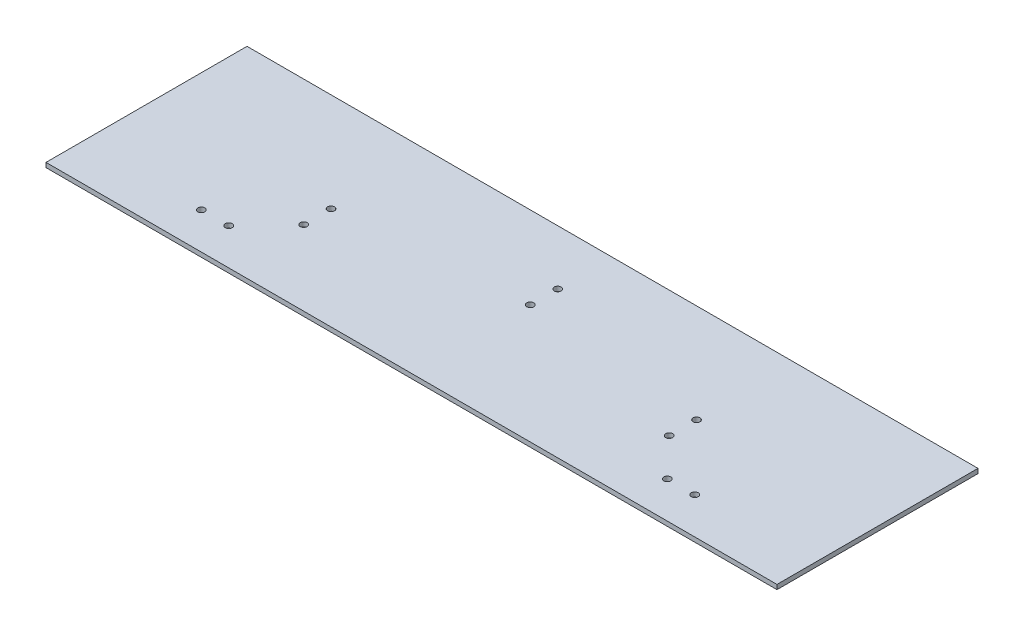
ISO-10303-21;
HEADER;
FILE_DESCRIPTION(('STEP AP214'),'2;1');
FILE_NAME('part.step','',(''),(''),'','','');
FILE_SCHEMA(('AUTOMOTIVE_DESIGN { 1 0 10303 214 1 1 1 1 }'));
ENDSEC;
DATA;
#1=APPLICATION_CONTEXT('core data for automotive mechanical design processes');
#2=APPLICATION_PROTOCOL_DEFINITION('international standard','automotive_design',2000,#1);
#3=PRODUCT_CONTEXT('',#1,'mechanical');
#4=PRODUCT('Part','Part','',(#3));
#5=PRODUCT_RELATED_PRODUCT_CATEGORY('part','',(#4));
#6=PRODUCT_DEFINITION_FORMATION('','',#4);
#7=PRODUCT_DEFINITION_CONTEXT('part definition',#1,'design');
#8=PRODUCT_DEFINITION('design','',#6,#7);
#9=PRODUCT_DEFINITION_SHAPE('','',#8);
#10=(LENGTH_UNIT() NAMED_UNIT(*) SI_UNIT(.MILLI.,.METRE.));
#11=(NAMED_UNIT(*) PLANE_ANGLE_UNIT() SI_UNIT($,.RADIAN.));
#12=(NAMED_UNIT(*) SI_UNIT($,.STERADIAN.) SOLID_ANGLE_UNIT());
#13=UNCERTAINTY_MEASURE_WITH_UNIT(LENGTH_MEASURE(1.E-05),#10,'distance_accuracy_value','');
#14=(GEOMETRIC_REPRESENTATION_CONTEXT(3) GLOBAL_UNCERTAINTY_ASSIGNED_CONTEXT((#13)) GLOBAL_UNIT_ASSIGNED_CONTEXT((#10,
#11,#12)) REPRESENTATION_CONTEXT('',''));
#15=CARTESIAN_POINT('',(0.,0.,0.));
#16=DIRECTION('',(0.,0.,1.));
#17=DIRECTION('',(1.,0.,0.));
#18=AXIS2_PLACEMENT_3D('',#15,#16,#17);
#19=CARTESIAN_POINT('',(0.,3.175,0.));
#20=DIRECTION('',(1.,0.,0.));
#21=DIRECTION('',(0.,0.,-1.));
#22=AXIS2_PLACEMENT_3D('',#19,#20,#21);
#23=PLANE('',#22);
#24=DIRECTION('',(0.,0.,1.));
#25=VECTOR('',#24,1.);
#26=CARTESIAN_POINT('',(0.,0.,0.));
#27=LINE('',#26,#25);
#28=CARTESIAN_POINT('',(0.,0.,0.));
#29=VERTEX_POINT('',#28);
#30=CARTESIAN_POINT('',(0.,0.,139.7));
#31=VERTEX_POINT('',#30);
#32=EDGE_CURVE('E96',#29,#31,#27,.T.);
#33=ORIENTED_EDGE('',*,*,#32,.T.);
#34=DIRECTION('',(0.,-1.,0.));
#35=VECTOR('',#34,1.);
#36=CARTESIAN_POINT('',(0.,3.175,139.7));
#37=LINE('',#36,#35);
#38=CARTESIAN_POINT('',(0.,3.175,139.7));
#39=VERTEX_POINT('',#38);
#40=EDGE_CURVE('E11',#39,#31,#37,.T.);
#41=ORIENTED_EDGE('',*,*,#40,.F.);
#42=DIRECTION('',(0.,0.,1.));
#43=VECTOR('',#42,1.);
#44=CARTESIAN_POINT('',(0.,3.175,0.));
#45=LINE('',#44,#43);
#46=CARTESIAN_POINT('',(0.,3.175,0.));
#47=VERTEX_POINT('',#46);
#48=EDGE_CURVE('E84',#47,#39,#45,.T.);
#49=ORIENTED_EDGE('',*,*,#48,.F.);
#50=DIRECTION('',(0.,-1.,0.));
#51=VECTOR('',#50,1.);
#52=CARTESIAN_POINT('',(0.,3.175,0.));
#53=LINE('',#52,#51);
#54=EDGE_CURVE('E92',#47,#29,#53,.T.);
#55=ORIENTED_EDGE('',*,*,#54,.T.);
#56=EDGE_LOOP('',(#33,#41,#49,#55));
#57=FACE_BOUND('',#56,.T.);
#58=ADVANCED_FACE('F33',(#57),#23,.F.);
#59=CARTESIAN_POINT('',(0.,3.175,139.7));
#60=DIRECTION('',(0.,0.,-1.));
#61=DIRECTION('',(-1.,0.,0.));
#62=AXIS2_PLACEMENT_3D('',#59,#60,#61);
#63=PLANE('',#62);
#64=DIRECTION('',(1.,0.,0.));
#65=VECTOR('',#64,1.);
#66=CARTESIAN_POINT('',(0.,0.,139.7));
#67=LINE('',#66,#65);
#68=CARTESIAN_POINT('',(508.,0.,139.7));
#69=VERTEX_POINT('',#68);
#70=EDGE_CURVE('E88',#31,#69,#67,.T.);
#71=ORIENTED_EDGE('',*,*,#70,.T.);
#72=DIRECTION('',(0.,-1.,0.));
#73=VECTOR('',#72,1.);
#74=CARTESIAN_POINT('',(508.,3.175,139.7));
#75=LINE('',#74,#73);
#76=CARTESIAN_POINT('',(508.,3.175,139.7));
#77=VERTEX_POINT('',#76);
#78=EDGE_CURVE('E41',#77,#69,#75,.T.);
#79=ORIENTED_EDGE('',*,*,#78,.F.);
#80=DIRECTION('',(1.,0.,0.));
#81=VECTOR('',#80,1.);
#82=CARTESIAN_POINT('',(0.,3.175,139.7));
#83=LINE('',#82,#81);
#84=EDGE_CURVE('E79',#39,#77,#83,.T.);
#85=ORIENTED_EDGE('',*,*,#84,.F.);
#86=ORIENTED_EDGE('',*,*,#40,.T.);
#87=EDGE_LOOP('',(#71,#79,#85,#86));
#88=FACE_BOUND('',#87,.T.);
#89=ADVANCED_FACE('F87',(#88),#63,.F.);
#90=CARTESIAN_POINT('',(508.,3.175,0.));
#91=DIRECTION('',(-1.,0.,0.));
#92=DIRECTION('',(0.,0.,1.));
#93=AXIS2_PLACEMENT_3D('',#90,#91,#92);
#94=PLANE('',#93);
#95=DIRECTION('',(0.,0.,-1.));
#96=VECTOR('',#95,1.);
#97=CARTESIAN_POINT('',(508.,0.,0.));
#98=LINE('',#97,#96);
#99=CARTESIAN_POINT('',(508.,0.,0.));
#100=VERTEX_POINT('',#99);
#101=EDGE_CURVE('E66',#69,#100,#98,.T.);
#102=ORIENTED_EDGE('',*,*,#101,.T.);
#103=DIRECTION('',(0.,-1.,0.));
#104=VECTOR('',#103,1.);
#105=CARTESIAN_POINT('',(508.,3.175,0.));
#106=LINE('',#105,#104);
#107=CARTESIAN_POINT('',(508.,3.175,0.));
#108=VERTEX_POINT('',#107);
#109=EDGE_CURVE('E89',#108,#100,#106,.T.);
#110=ORIENTED_EDGE('',*,*,#109,.F.);
#111=DIRECTION('',(0.,0.,-1.));
#112=VECTOR('',#111,1.);
#113=CARTESIAN_POINT('',(508.,3.175,0.));
#114=LINE('',#113,#112);
#115=EDGE_CURVE('E82',#77,#108,#114,.T.);
#116=ORIENTED_EDGE('',*,*,#115,.F.);
#117=ORIENTED_EDGE('',*,*,#78,.T.);
#118=EDGE_LOOP('',(#102,#110,#116,#117));
#119=FACE_BOUND('',#118,.T.);
#120=ADVANCED_FACE('F90',(#119),#94,.F.);
#121=CARTESIAN_POINT('',(0.,3.175,0.));
#122=DIRECTION('',(0.,0.,1.));
#123=DIRECTION('',(1.,0.,0.));
#124=AXIS2_PLACEMENT_3D('',#121,#122,#123);
#125=PLANE('',#124);
#126=DIRECTION('',(-1.,0.,0.));
#127=VECTOR('',#126,1.);
#128=CARTESIAN_POINT('',(0.,0.,0.));
#129=LINE('',#128,#127);
#130=EDGE_CURVE('E72',#100,#29,#129,.T.);
#131=ORIENTED_EDGE('',*,*,#130,.T.);
#132=ORIENTED_EDGE('',*,*,#54,.F.);
#133=DIRECTION('',(-1.,0.,0.));
#134=VECTOR('',#133,1.);
#135=CARTESIAN_POINT('',(0.,3.175,0.));
#136=LINE('',#135,#134);
#137=EDGE_CURVE('E49',#108,#47,#136,.T.);
#138=ORIENTED_EDGE('',*,*,#137,.F.);
#139=ORIENTED_EDGE('',*,*,#109,.T.);
#140=EDGE_LOOP('',(#131,#132,#138,#139));
#141=FACE_BOUND('',#140,.T.);
#142=ADVANCED_FACE('F104',(#141),#125,.F.);
#143=CARTESIAN_POINT('',(0.,3.175,0.));
#144=DIRECTION('',(0.,1.,0.));
#145=DIRECTION('',(0.,0.,1.));
#146=AXIS2_PLACEMENT_3D('',#143,#144,#145);
#147=PLANE('',#146);
#148=CARTESIAN_POINT('',(82.55,3.175,114.3));
#149=DIRECTION('',(0.,1.,0.));
#150=DIRECTION('',(0.,0.,1.));
#151=AXIS2_PLACEMENT_3D('',#148,#149,#150);
#152=CIRCLE('',#151,2.41299999999999);
#153=CARTESIAN_POINT('',(82.55,3.175,116.713));
#154=VERTEX_POINT('',#153);
#155=EDGE_CURVE('E133',#154,#154,#152,.T.);
#156=ORIENTED_EDGE('',*,*,#155,.F.);
#157=EDGE_LOOP('',(#156));
#158=FACE_BOUND('',#157,.T.);
#159=CARTESIAN_POINT('',(381.,3.175,68.58));
#160=DIRECTION('',(0.,1.,0.));
#161=DIRECTION('',(0.,0.,1.));
#162=AXIS2_PLACEMENT_3D('',#159,#160,#161);
#163=CIRCLE('',#162,2.41299999999999);
#164=CARTESIAN_POINT('',(381.,3.175,70.993));
#165=VERTEX_POINT('',#164);
#166=EDGE_CURVE('E162',#165,#165,#163,.T.);
#167=ORIENTED_EDGE('',*,*,#166,.F.);
#168=EDGE_LOOP('',(#167));
#169=FACE_BOUND('',#168,.T.);
#170=CARTESIAN_POINT('',(101.6,3.175,114.3));
#171=DIRECTION('',(0.,1.,0.));
#172=DIRECTION('',(0.,0.,1.));
#173=AXIS2_PLACEMENT_3D('',#170,#171,#172);
#174=CIRCLE('',#173,2.41299999999999);
#175=CARTESIAN_POINT('',(101.6,3.175,116.713));
#176=VERTEX_POINT('',#175);
#177=EDGE_CURVE('E127',#176,#176,#174,.T.);
#178=ORIENTED_EDGE('',*,*,#177,.F.);
#179=EDGE_LOOP('',(#178));
#180=FACE_BOUND('',#179,.T.);
#181=CARTESIAN_POINT('',(127.,3.175,87.63));
#182=DIRECTION('',(0.,1.,0.));
#183=DIRECTION('',(0.,0.,1.));
#184=AXIS2_PLACEMENT_3D('',#181,#182,#183);
#185=CIRCLE('',#184,2.41299999999999);
#186=CARTESIAN_POINT('',(127.,3.175,90.043));
#187=VERTEX_POINT('',#186);
#188=EDGE_CURVE('E121',#187,#187,#185,.T.);
#189=ORIENTED_EDGE('',*,*,#188,.F.);
#190=EDGE_LOOP('',(#189));
#191=FACE_BOUND('',#190,.T.);
#192=CARTESIAN_POINT('',(127.,3.175,68.58));
#193=DIRECTION('',(0.,1.,0.));
#194=DIRECTION('',(0.,0.,1.));
#195=AXIS2_PLACEMENT_3D('',#192,#193,#194);
#196=CIRCLE('',#195,2.41299999999999);
#197=CARTESIAN_POINT('',(127.,3.175,70.993));
#198=VERTEX_POINT('',#197);
#199=EDGE_CURVE('E113',#198,#198,#196,.T.);
#200=ORIENTED_EDGE('',*,*,#199,.F.);
#201=EDGE_LOOP('',(#200));
#202=FACE_BOUND('',#201,.T.);
#203=CARTESIAN_POINT('',(254.,3.175,38.1));
#204=DIRECTION('',(0.,1.,0.));
#205=DIRECTION('',(0.,0.,1.));
#206=AXIS2_PLACEMENT_3D('',#203,#204,#205);
#207=CIRCLE('',#206,2.41299999999999);
#208=CARTESIAN_POINT('',(254.,3.175,40.513));
#209=VERTEX_POINT('',#208);
#210=EDGE_CURVE('E114',#209,#209,#207,.T.);
#211=ORIENTED_EDGE('',*,*,#210,.F.);
#212=EDGE_LOOP('',(#211));
#213=FACE_BOUND('',#212,.T.);
#214=CARTESIAN_POINT('',(381.,3.175,87.63));
#215=DIRECTION('',(0.,1.,0.));
#216=DIRECTION('',(0.,0.,1.));
#217=AXIS2_PLACEMENT_3D('',#214,#215,#216);
#218=CIRCLE('',#217,2.41299999999999);
#219=CARTESIAN_POINT('',(381.,3.175,90.043));
#220=VERTEX_POINT('',#219);
#221=EDGE_CURVE('E152',#220,#220,#218,.T.);
#222=ORIENTED_EDGE('',*,*,#221,.F.);
#223=EDGE_LOOP('',(#222));
#224=FACE_BOUND('',#223,.T.);
#225=CARTESIAN_POINT('',(406.4,3.175,114.3));
#226=DIRECTION('',(0.,1.,0.));
#227=DIRECTION('',(0.,0.,1.));
#228=AXIS2_PLACEMENT_3D('',#225,#226,#227);
#229=CIRCLE('',#228,2.41299999999999);
#230=CARTESIAN_POINT('',(406.4,3.175,116.713));
#231=VERTEX_POINT('',#230);
#232=EDGE_CURVE('E151',#231,#231,#229,.T.);
#233=ORIENTED_EDGE('',*,*,#232,.F.);
#234=EDGE_LOOP('',(#233));
#235=FACE_BOUND('',#234,.T.);
#236=CARTESIAN_POINT('',(425.45,3.175,114.3));
#237=DIRECTION('',(0.,1.,0.));
#238=DIRECTION('',(0.,0.,1.));
#239=AXIS2_PLACEMENT_3D('',#236,#237,#238);
#240=CIRCLE('',#239,2.41299999999999);
#241=CARTESIAN_POINT('',(425.45,3.175,116.713));
#242=VERTEX_POINT('',#241);
#243=EDGE_CURVE('E140',#242,#242,#240,.T.);
#244=ORIENTED_EDGE('',*,*,#243,.F.);
#245=EDGE_LOOP('',(#244));
#246=FACE_BOUND('',#245,.T.);
#247=CARTESIAN_POINT('',(254.,3.175,57.15));
#248=DIRECTION('',(0.,1.,0.));
#249=DIRECTION('',(0.,0.,1.));
#250=AXIS2_PLACEMENT_3D('',#247,#248,#249);
#251=CIRCLE('',#250,2.41299999999999);
#252=CARTESIAN_POINT('',(254.,3.175,59.563));
#253=VERTEX_POINT('',#252);
#254=EDGE_CURVE('E139',#253,#253,#251,.T.);
#255=ORIENTED_EDGE('',*,*,#254,.F.);
#256=EDGE_LOOP('',(#255));
#257=FACE_BOUND('',#256,.T.);
#258=ORIENTED_EDGE('',*,*,#48,.T.);
#259=ORIENTED_EDGE('',*,*,#84,.T.);
#260=ORIENTED_EDGE('',*,*,#115,.T.);
#261=ORIENTED_EDGE('',*,*,#137,.T.);
#262=EDGE_LOOP('',(#258,#259,#260,#261));
#263=FACE_BOUND('',#262,.T.);
#264=ADVANCED_FACE('F80',(#158,#169,#180,#191,#202,#213,#224,#235,#246,#257,#263),#147,.T.);
#265=CARTESIAN_POINT('',(0.,0.,0.));
#266=DIRECTION('',(0.,1.,0.));
#267=DIRECTION('',(0.,0.,1.));
#268=AXIS2_PLACEMENT_3D('',#265,#266,#267);
#269=PLANE('',#268);
#270=CARTESIAN_POINT('',(82.55,0.,114.3));
#271=DIRECTION('',(0.,1.,0.));
#272=DIRECTION('',(0.,0.,1.));
#273=AXIS2_PLACEMENT_3D('',#270,#271,#272);
#274=CIRCLE('',#273,2.41299999999999);
#275=CARTESIAN_POINT('',(82.55,0.,116.713));
#276=VERTEX_POINT('',#275);
#277=EDGE_CURVE('E99',#276,#276,#274,.F.);
#278=ORIENTED_EDGE('',*,*,#277,.F.);
#279=EDGE_LOOP('',(#278));
#280=FACE_BOUND('',#279,.T.);
#281=CARTESIAN_POINT('',(381.,0.,68.58));
#282=DIRECTION('',(0.,1.,0.));
#283=DIRECTION('',(0.,0.,1.));
#284=AXIS2_PLACEMENT_3D('',#281,#282,#283);
#285=CIRCLE('',#284,2.41299999999999);
#286=CARTESIAN_POINT('',(381.,0.,70.993));
#287=VERTEX_POINT('',#286);
#288=EDGE_CURVE('E155',#287,#287,#285,.F.);
#289=ORIENTED_EDGE('',*,*,#288,.F.);
#290=EDGE_LOOP('',(#289));
#291=FACE_BOUND('',#290,.T.);
#292=CARTESIAN_POINT('',(101.6,0.,114.3));
#293=DIRECTION('',(0.,1.,0.));
#294=DIRECTION('',(0.,0.,1.));
#295=AXIS2_PLACEMENT_3D('',#292,#293,#294);
#296=CIRCLE('',#295,2.41299999999999);
#297=CARTESIAN_POINT('',(101.6,0.,116.713));
#298=VERTEX_POINT('',#297);
#299=EDGE_CURVE('E130',#298,#298,#296,.F.);
#300=ORIENTED_EDGE('',*,*,#299,.F.);
#301=EDGE_LOOP('',(#300));
#302=FACE_BOUND('',#301,.T.);
#303=CARTESIAN_POINT('',(127.,0.,87.63));
#304=DIRECTION('',(0.,1.,0.));
#305=DIRECTION('',(0.,0.,1.));
#306=AXIS2_PLACEMENT_3D('',#303,#304,#305);
#307=CIRCLE('',#306,2.41299999999999);
#308=CARTESIAN_POINT('',(127.,0.,90.043));
#309=VERTEX_POINT('',#308);
#310=EDGE_CURVE('E124',#309,#309,#307,.F.);
#311=ORIENTED_EDGE('',*,*,#310,.F.);
#312=EDGE_LOOP('',(#311));
#313=FACE_BOUND('',#312,.T.);
#314=CARTESIAN_POINT('',(127.,0.,68.58));
#315=DIRECTION('',(0.,1.,0.));
#316=DIRECTION('',(0.,0.,1.));
#317=AXIS2_PLACEMENT_3D('',#314,#315,#316);
#318=CIRCLE('',#317,2.41299999999999);
#319=CARTESIAN_POINT('',(127.,0.,70.993));
#320=VERTEX_POINT('',#319);
#321=EDGE_CURVE('E118',#320,#320,#318,.F.);
#322=ORIENTED_EDGE('',*,*,#321,.F.);
#323=EDGE_LOOP('',(#322));
#324=FACE_BOUND('',#323,.T.);
#325=CARTESIAN_POINT('',(254.,0.,38.1));
#326=DIRECTION('',(0.,1.,0.));
#327=DIRECTION('',(0.,0.,1.));
#328=AXIS2_PLACEMENT_3D('',#325,#326,#327);
#329=CIRCLE('',#328,2.41299999999999);
#330=CARTESIAN_POINT('',(254.,0.,40.513));
#331=VERTEX_POINT('',#330);
#332=EDGE_CURVE('E110',#331,#331,#329,.F.);
#333=ORIENTED_EDGE('',*,*,#332,.F.);
#334=EDGE_LOOP('',(#333));
#335=FACE_BOUND('',#334,.T.);
#336=CARTESIAN_POINT('',(381.,0.,87.63));
#337=DIRECTION('',(0.,1.,0.));
#338=DIRECTION('',(0.,0.,1.));
#339=AXIS2_PLACEMENT_3D('',#336,#337,#338);
#340=CIRCLE('',#339,2.41299999999999);
#341=CARTESIAN_POINT('',(381.,0.,90.043));
#342=VERTEX_POINT('',#341);
#343=EDGE_CURVE('E148',#342,#342,#340,.F.);
#344=ORIENTED_EDGE('',*,*,#343,.F.);
#345=EDGE_LOOP('',(#344));
#346=FACE_BOUND('',#345,.T.);
#347=CARTESIAN_POINT('',(406.4,0.,114.3));
#348=DIRECTION('',(0.,1.,0.));
#349=DIRECTION('',(0.,0.,1.));
#350=AXIS2_PLACEMENT_3D('',#347,#348,#349);
#351=CIRCLE('',#350,2.41299999999999);
#352=CARTESIAN_POINT('',(406.4,0.,116.713));
#353=VERTEX_POINT('',#352);
#354=EDGE_CURVE('E143',#353,#353,#351,.F.);
#355=ORIENTED_EDGE('',*,*,#354,.F.);
#356=EDGE_LOOP('',(#355));
#357=FACE_BOUND('',#356,.T.);
#358=CARTESIAN_POINT('',(425.45,0.,114.3));
#359=DIRECTION('',(0.,1.,0.));
#360=DIRECTION('',(0.,0.,1.));
#361=AXIS2_PLACEMENT_3D('',#358,#359,#360);
#362=CIRCLE('',#361,2.41299999999999);
#363=CARTESIAN_POINT('',(425.45,0.,116.713));
#364=VERTEX_POINT('',#363);
#365=EDGE_CURVE('E136',#364,#364,#362,.F.);
#366=ORIENTED_EDGE('',*,*,#365,.F.);
#367=EDGE_LOOP('',(#366));
#368=FACE_BOUND('',#367,.T.);
#369=CARTESIAN_POINT('',(254.,0.,57.15));
#370=DIRECTION('',(0.,1.,0.));
#371=DIRECTION('',(0.,0.,1.));
#372=AXIS2_PLACEMENT_3D('',#369,#370,#371);
#373=CIRCLE('',#372,2.41299999999999);
#374=CARTESIAN_POINT('',(254.,0.,59.563));
#375=VERTEX_POINT('',#374);
#376=EDGE_CURVE('E117',#375,#375,#373,.F.);
#377=ORIENTED_EDGE('',*,*,#376,.F.);
#378=EDGE_LOOP('',(#377));
#379=FACE_BOUND('',#378,.T.);
#380=ORIENTED_EDGE('',*,*,#32,.F.);
#381=ORIENTED_EDGE('',*,*,#130,.F.);
#382=ORIENTED_EDGE('',*,*,#101,.F.);
#383=ORIENTED_EDGE('',*,*,#70,.F.);
#384=EDGE_LOOP('',(#380,#381,#382,#383));
#385=FACE_BOUND('',#384,.T.);
#386=ADVANCED_FACE('F107',(#280,#291,#302,#313,#324,#335,#346,#357,#368,#379,#385),#269,.F.);
#387=CARTESIAN_POINT('',(254.,-6.82499465201255,57.15));
#388=DIRECTION('',(0.,1.,0.));
#389=DIRECTION('',(0.,0.,1.));
#390=AXIS2_PLACEMENT_3D('',#387,#388,#389);
#391=CYLINDRICAL_SURFACE('',#390,2.41299999999999);
#392=ORIENTED_EDGE('',*,*,#376,.T.);
#393=EDGE_LOOP('',(#392));
#394=FACE_BOUND('',#393,.T.);
#395=ORIENTED_EDGE('',*,*,#254,.T.);
#396=EDGE_LOOP('',(#395));
#397=FACE_BOUND('',#396,.T.);
#398=ADVANCED_FACE('F193',(#394,#397),#391,.F.);
#399=CARTESIAN_POINT('',(425.45,-6.82499465201255,114.3));
#400=DIRECTION('',(0.,1.,0.));
#401=DIRECTION('',(0.,0.,1.));
#402=AXIS2_PLACEMENT_3D('',#399,#400,#401);
#403=CYLINDRICAL_SURFACE('',#402,2.41299999999999);
#404=ORIENTED_EDGE('',*,*,#365,.T.);
#405=EDGE_LOOP('',(#404));
#406=FACE_BOUND('',#405,.T.);
#407=ORIENTED_EDGE('',*,*,#243,.T.);
#408=EDGE_LOOP('',(#407));
#409=FACE_BOUND('',#408,.T.);
#410=ADVANCED_FACE('F195',(#406,#409),#403,.F.);
#411=CARTESIAN_POINT('',(406.4,-6.82499465201255,114.3));
#412=DIRECTION('',(0.,1.,0.));
#413=DIRECTION('',(0.,0.,1.));
#414=AXIS2_PLACEMENT_3D('',#411,#412,#413);
#415=CYLINDRICAL_SURFACE('',#414,2.41299999999999);
#416=ORIENTED_EDGE('',*,*,#354,.T.);
#417=EDGE_LOOP('',(#416));
#418=FACE_BOUND('',#417,.T.);
#419=ORIENTED_EDGE('',*,*,#232,.T.);
#420=EDGE_LOOP('',(#419));
#421=FACE_BOUND('',#420,.T.);
#422=ADVANCED_FACE('F202',(#418,#421),#415,.F.);
#423=CARTESIAN_POINT('',(381.,-6.82499465201255,87.63));
#424=DIRECTION('',(0.,1.,0.));
#425=DIRECTION('',(0.,0.,1.));
#426=AXIS2_PLACEMENT_3D('',#423,#424,#425);
#427=CYLINDRICAL_SURFACE('',#426,2.41299999999999);
#428=ORIENTED_EDGE('',*,*,#343,.T.);
#429=EDGE_LOOP('',(#428));
#430=FACE_BOUND('',#429,.T.);
#431=ORIENTED_EDGE('',*,*,#221,.T.);
#432=EDGE_LOOP('',(#431));
#433=FACE_BOUND('',#432,.T.);
#434=ADVANCED_FACE('F223',(#430,#433),#427,.F.);
#435=CARTESIAN_POINT('',(254.,-6.82499465201255,38.1));
#436=DIRECTION('',(0.,1.,0.));
#437=DIRECTION('',(0.,0.,1.));
#438=AXIS2_PLACEMENT_3D('',#435,#436,#437);
#439=CYLINDRICAL_SURFACE('',#438,2.41299999999999);
#440=ORIENTED_EDGE('',*,*,#332,.T.);
#441=EDGE_LOOP('',(#440));
#442=FACE_BOUND('',#441,.T.);
#443=ORIENTED_EDGE('',*,*,#210,.T.);
#444=EDGE_LOOP('',(#443));
#445=FACE_BOUND('',#444,.T.);
#446=ADVANCED_FACE('F219',(#442,#445),#439,.F.);
#447=CARTESIAN_POINT('',(127.,-6.82499465201255,68.58));
#448=DIRECTION('',(0.,1.,0.));
#449=DIRECTION('',(0.,0.,1.));
#450=AXIS2_PLACEMENT_3D('',#447,#448,#449);
#451=CYLINDRICAL_SURFACE('',#450,2.41299999999999);
#452=ORIENTED_EDGE('',*,*,#321,.T.);
#453=EDGE_LOOP('',(#452));
#454=FACE_BOUND('',#453,.T.);
#455=ORIENTED_EDGE('',*,*,#199,.T.);
#456=EDGE_LOOP('',(#455));
#457=FACE_BOUND('',#456,.T.);
#458=ADVANCED_FACE('F222',(#454,#457),#451,.F.);
#459=CARTESIAN_POINT('',(127.,-6.82499465201255,87.63));
#460=DIRECTION('',(0.,1.,0.));
#461=DIRECTION('',(0.,0.,1.));
#462=AXIS2_PLACEMENT_3D('',#459,#460,#461);
#463=CYLINDRICAL_SURFACE('',#462,2.41299999999999);
#464=ORIENTED_EDGE('',*,*,#310,.T.);
#465=EDGE_LOOP('',(#464));
#466=FACE_BOUND('',#465,.T.);
#467=ORIENTED_EDGE('',*,*,#188,.T.);
#468=EDGE_LOOP('',(#467));
#469=FACE_BOUND('',#468,.T.);
#470=ADVANCED_FACE('F227',(#466,#469),#463,.F.);
#471=CARTESIAN_POINT('',(101.6,-6.82499465201255,114.3));
#472=DIRECTION('',(0.,1.,0.));
#473=DIRECTION('',(0.,0.,1.));
#474=AXIS2_PLACEMENT_3D('',#471,#472,#473);
#475=CYLINDRICAL_SURFACE('',#474,2.41299999999999);
#476=ORIENTED_EDGE('',*,*,#299,.T.);
#477=EDGE_LOOP('',(#476));
#478=FACE_BOUND('',#477,.T.);
#479=ORIENTED_EDGE('',*,*,#177,.T.);
#480=EDGE_LOOP('',(#479));
#481=FACE_BOUND('',#480,.T.);
#482=ADVANCED_FACE('F231',(#478,#481),#475,.F.);
#483=CARTESIAN_POINT('',(381.,-6.82499465201255,68.58));
#484=DIRECTION('',(0.,1.,0.));
#485=DIRECTION('',(0.,0.,1.));
#486=AXIS2_PLACEMENT_3D('',#483,#484,#485);
#487=CYLINDRICAL_SURFACE('',#486,2.41299999999999);
#488=ORIENTED_EDGE('',*,*,#288,.T.);
#489=EDGE_LOOP('',(#488));
#490=FACE_BOUND('',#489,.T.);
#491=ORIENTED_EDGE('',*,*,#166,.T.);
#492=EDGE_LOOP('',(#491));
#493=FACE_BOUND('',#492,.T.);
#494=ADVANCED_FACE('F234',(#490,#493),#487,.F.);
#495=CARTESIAN_POINT('',(82.55,-6.82499465201255,114.3));
#496=DIRECTION('',(0.,1.,0.));
#497=DIRECTION('',(0.,0.,1.));
#498=AXIS2_PLACEMENT_3D('',#495,#496,#497);
#499=CYLINDRICAL_SURFACE('',#498,2.41299999999999);
#500=ORIENTED_EDGE('',*,*,#277,.T.);
#501=EDGE_LOOP('',(#500));
#502=FACE_BOUND('',#501,.T.);
#503=ORIENTED_EDGE('',*,*,#155,.T.);
#504=EDGE_LOOP('',(#503));
#505=FACE_BOUND('',#504,.T.);
#506=ADVANCED_FACE('F170',(#502,#505),#499,.F.);
#507=CLOSED_SHELL('',(#58,#89,#120,#142,#264,#386,#398,#410,#422,#434,#446,#458,#470,#482,#494,#506));
#508=MANIFOLD_SOLID_BREP('B2',#507);
#509=ADVANCED_BREP_SHAPE_REPRESENTATION('',(#18,#508),#14);
#510=SHAPE_DEFINITION_REPRESENTATION(#9,#509);
ENDSEC;
END-ISO-10303-21;
